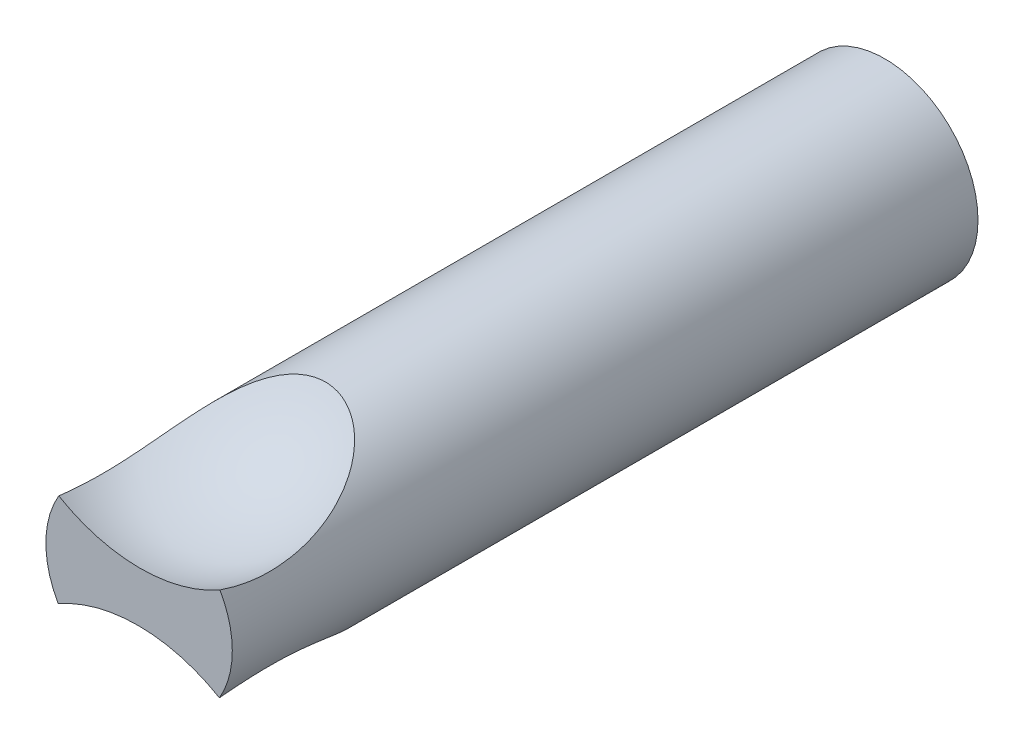
ISO-10303-21;
HEADER;
FILE_DESCRIPTION(('STEP AP214'),'2;1');
FILE_NAME('part.step','',(''),(''),'','','');
FILE_SCHEMA(('AUTOMOTIVE_DESIGN { 1 0 10303 214 1 1 1 1 }'));
ENDSEC;
DATA;
#1=APPLICATION_CONTEXT('core data for automotive mechanical design processes');
#2=APPLICATION_PROTOCOL_DEFINITION('international standard','automotive_design',2000,#1);
#3=PRODUCT_CONTEXT('',#1,'mechanical');
#4=PRODUCT('Part','Part','',(#3));
#5=PRODUCT_RELATED_PRODUCT_CATEGORY('part','',(#4));
#6=PRODUCT_DEFINITION_FORMATION('','',#4);
#7=PRODUCT_DEFINITION_CONTEXT('part definition',#1,'design');
#8=PRODUCT_DEFINITION('design','',#6,#7);
#9=PRODUCT_DEFINITION_SHAPE('','',#8);
#10=(LENGTH_UNIT() NAMED_UNIT(*) SI_UNIT(.MILLI.,.METRE.));
#11=(NAMED_UNIT(*) PLANE_ANGLE_UNIT() SI_UNIT($,.RADIAN.));
#12=(NAMED_UNIT(*) SI_UNIT($,.STERADIAN.) SOLID_ANGLE_UNIT());
#13=UNCERTAINTY_MEASURE_WITH_UNIT(LENGTH_MEASURE(1.E-05),#10,'distance_accuracy_value','');
#14=(GEOMETRIC_REPRESENTATION_CONTEXT(3) GLOBAL_UNCERTAINTY_ASSIGNED_CONTEXT((#13)) GLOBAL_UNIT_ASSIGNED_CONTEXT((#10,
#11,#12)) REPRESENTATION_CONTEXT('',''));
#15=CARTESIAN_POINT('',(0.,0.,0.));
#16=DIRECTION('',(0.,0.,1.));
#17=DIRECTION('',(1.,0.,0.));
#18=AXIS2_PLACEMENT_3D('',#15,#16,#17);
#19=CARTESIAN_POINT('',(0.,0.,0.));
#20=DIRECTION('',(0.,0.,1.));
#21=DIRECTION('',(1.,0.,0.));
#22=AXIS2_PLACEMENT_3D('',#19,#20,#21);
#23=CYLINDRICAL_SURFACE('',#22,12.7);
#24=CARTESIAN_POINT('',(0.,0.,-101.6));
#25=DIRECTION('',(0.,0.,1.));
#26=DIRECTION('',(1.,0.,0.));
#27=AXIS2_PLACEMENT_3D('',#24,#25,#26);
#28=CIRCLE('',#27,12.7);
#29=CARTESIAN_POINT('',(12.7,0.,-101.6));
#30=VERTEX_POINT('',#29);
#31=EDGE_CURVE('E70',#30,#30,#28,.T.);
#32=ORIENTED_EDGE('',*,*,#31,.T.);
#33=EDGE_LOOP('',(#32));
#34=FACE_BOUND('',#33,.T.);
#35=CARTESIAN_POINT('',(0.,0.,0.));
#36=DIRECTION('',(0.,0.,1.));
#37=DIRECTION('',(1.,0.,0.));
#38=AXIS2_PLACEMENT_3D('',#35,#36,#37);
#39=CIRCLE('',#38,12.7);
#40=CARTESIAN_POINT('',(10.9442336249683,-6.44311651005266,0.));
#41=VERTEX_POINT('',#40);
#42=CARTESIAN_POINT('',(11.0153436020415,6.32077569044845,0.));
#43=VERTEX_POINT('',#42);
#44=EDGE_CURVE('E67',#41,#43,#39,.T.);
#45=ORIENTED_EDGE('',*,*,#44,.F.);
#46=CARTESIAN_POINT('',(10.9442042844606,-6.44316634737872,0.000200000000000659));
#47=CARTESIAN_POINT('',(10.9820076797341,-6.37893548211798,-0.257531917326904));
#48=CARTESIAN_POINT('',(11.0169570010032,-6.31829670516524,-0.516574142293161));
#49=CARTESIAN_POINT('',(11.081461849067,-6.20447792054995,-1.03695611210328));
#50=CARTESIAN_POINT('',(11.1110174289167,-6.15129783952181,-1.29829583432151));
#51=CARTESIAN_POINT('',(11.1650464014589,-6.05267611276471,-1.82292101893643));
#52=CARTESIAN_POINT('',(11.1895204478493,-6.00723347181234,-2.08620622654391));
#53=CARTESIAN_POINT('',(11.2336476153591,-5.9243018027941,-2.61441559787994));
#54=CARTESIAN_POINT('',(11.2533007206288,-5.88681280087694,-2.87933976699385));
#55=CARTESIAN_POINT('',(11.3053296514065,-5.78665102480421,-3.67548054986068));
#56=CARTESIAN_POINT('',(11.3308444400335,-5.73615358711074,-4.20875249666291));
#57=CARTESIAN_POINT('',(11.3647331267084,-5.66870322467448,-5.27794283850334));
#58=CARTESIAN_POINT('',(11.373105208737,-5.65175385386569,-5.81386150789564));
#59=CARTESIAN_POINT('',(11.3731181068212,-5.65175827277442,-6.99127132063171));
#60=CARTESIAN_POINT('',(11.3611416986637,-5.67604118105522,-7.63278150896929));
#61=CARTESIAN_POINT('',(11.3124268648063,-5.77250844721932,-8.91130160618086));
#62=CARTESIAN_POINT('',(11.2756848059055,-5.84469983340699,-9.5483108408931));
#63=CARTESIAN_POINT('',(11.1749130342367,-6.03514261754072,-10.8147522677516));
#64=CARTESIAN_POINT('',(11.110820213725,-6.15350048302684,-11.4441634532402));
#65=CARTESIAN_POINT('',(10.9514363096182,-6.43287457505314,-12.6893863339042));
#66=CARTESIAN_POINT('',(10.8561475636867,-6.59388760506022,-13.3051990443902));
#67=CARTESIAN_POINT('',(10.6285962614954,-6.95475748288803,-14.5215849638082));
#68=CARTESIAN_POINT('',(10.4961648565551,-7.15479041820171,-15.1220745852325));
#69=CARTESIAN_POINT('',(10.1879319550013,-7.58726300345445,-16.3001866351298));
#70=CARTESIAN_POINT('',(10.0121156301282,-7.81971372142763,-16.8778011667751));
#71=CARTESIAN_POINT('',(9.61041585557241,-8.30840641696101,-18.0021070351676));
#72=CARTESIAN_POINT('',(9.3847266201491,-8.56455392480992,-18.5489082719709));
#73=CARTESIAN_POINT('',(8.87489508371701,-9.09178248788514,-19.6066716542961));
#74=CARTESIAN_POINT('',(8.59081872171284,-9.36284644665439,-20.1176733643336));
#75=CARTESIAN_POINT('',(8.11321506218924,-9.7729374817924,-20.8531005105631));
#76=CARTESIAN_POINT('',(7.94437194703063,-9.91097672353431,-21.0942877887903));
#77=CARTESIAN_POINT('',(7.58870928660985,-10.1858734621899,-21.5637838618446));
#78=CARTESIAN_POINT('',(7.40189201186729,-10.3227311059908,-21.7920942775296));
#79=CARTESIAN_POINT('',(7.00961667230995,-10.5930145779952,-22.2339441861003));
#80=CARTESIAN_POINT('',(6.80417322843412,-10.7264429942193,-22.4474950366274));
#81=CARTESIAN_POINT('',(6.37394151663585,-10.9875453952245,-22.8580303433999));
#82=CARTESIAN_POINT('',(6.14915640762253,-11.1152203145047,-23.0550174945014));
#83=CARTESIAN_POINT('',(5.72270792750069,-11.3396490677715,-23.3960465847484));
#84=CARTESIAN_POINT('',(5.52427122162314,-11.4378043368423,-23.5432030482055));
#85=CARTESIAN_POINT('',(5.11447944781201,-11.6268219164445,-23.8235310645928));
#86=CARTESIAN_POINT('',(4.9031270913456,-11.7176857485127,-23.9567055370059));
#87=CARTESIAN_POINT('',(4.46808806862796,-11.8903706403953,-24.2075359140492));
#88=CARTESIAN_POINT('',(4.24441072328907,-11.9721983968859,-24.3252033237137));
#89=CARTESIAN_POINT('',(3.78541568616707,-12.1251435280258,-24.5436106098362));
#90=CARTESIAN_POINT('',(3.55009981810283,-12.1962625736762,-24.6443531275606));
#91=CARTESIAN_POINT('',(3.10646436246534,-12.3160127867095,-24.8132018902771));
#92=CARTESIAN_POINT('',(2.89962621558651,-12.3664210538237,-24.8839467901612));
#93=CARTESIAN_POINT('',(2.47959439885494,-12.4574381463327,-25.0114505689185));
#94=CARTESIAN_POINT('',(2.26640186710286,-12.4980487148328,-25.0682119356355));
#95=CARTESIAN_POINT('',(1.83496251964225,-12.5686385448348,-25.1670011750845));
#96=CARTESIAN_POINT('',(1.61671731554386,-12.5986211478098,-25.2090336785798));
#97=CARTESIAN_POINT('',(1.17657393839343,-12.6473195946266,-25.2777998565141));
#98=CARTESIAN_POINT('',(0.954675711348258,-12.6660352717851,-25.3045333046177));
#99=CARTESIAN_POINT('',(0.50824959055181,-12.6918007937178,-25.3423556768875));
#100=CARTESIAN_POINT('',(0.283716118732721,-12.6988182099885,-25.3534011001233));
#101=CARTESIAN_POINT('',(-0.165625582343404,-12.7009072732764,-25.3595383805301));
#102=CARTESIAN_POINT('',(-0.39043381175637,-12.695978913511,-25.3546302286428));
#103=CARTESIAN_POINT('',(-0.838570241639726,-12.6742703764961,-25.3289357650434));
#104=CARTESIAN_POINT('',(-1.0618983764326,-12.6574896768199,-25.3081487534207));
#105=CARTESIAN_POINT('',(-1.50537107835578,-12.6124356801443,-25.2510096535637));
#106=CARTESIAN_POINT('',(-1.72551567805077,-12.5841625007887,-25.214657724661));
#107=CARTESIAN_POINT('',(-2.15204428904547,-12.5181204826773,-25.1287358607614));
#108=CARTESIAN_POINT('',(-2.35862056991829,-12.480793487334,-25.0797758189289));
#109=CARTESIAN_POINT('',(-2.76622806757851,-12.396825499268,-24.9686541368236));
#110=CARTESIAN_POINT('',(-2.96725959948413,-12.3501850370931,-24.9064932485332));
#111=CARTESIAN_POINT('',(-3.3628300632755,-12.2483914433685,-24.7696707870309));
#112=CARTESIAN_POINT('',(-3.55736795404735,-12.1932369546775,-24.6950072207229));
#113=CARTESIAN_POINT('',(-3.9391603159105,-12.0753036670106,-24.5339580708004));
#114=CARTESIAN_POINT('',(-4.12641329495258,-12.0125233168956,-24.4475701019619));
#115=CARTESIAN_POINT('',(-4.55809069609512,-11.8567907583657,-24.2312761669113));
#116=CARTESIAN_POINT('',(-4.79923008721467,-11.7610360782963,-24.0968042045703));
#117=CARTESIAN_POINT('',(-5.26609925791662,-11.559537353909,-23.8098125439967));
#118=CARTESIAN_POINT('',(-5.49182467277784,-11.4537905001831,-23.6572877669567));
#119=CARTESIAN_POINT('',(-5.92771837232355,-11.2344010704376,-23.3358951455887));
#120=CARTESIAN_POINT('',(-6.13786572397343,-11.1207482542814,-23.1670059899091));
#121=CARTESIAN_POINT('',(-6.5423103279476,-10.8877304597637,-22.8147777196696));
#122=CARTESIAN_POINT('',(-6.73660326059142,-10.7683639386134,-22.6314346935964));
#123=CARTESIAN_POINT('',(-7.18155841632776,-10.4790393002343,-22.1786557206873));
#124=CARTESIAN_POINT('',(-7.42506049189903,-10.3073245695837,-21.9032874196817));
#125=CARTESIAN_POINT('',(-7.88355064740844,-9.96103562632248,-21.3314283037417));
#126=CARTESIAN_POINT('',(-8.09852801874095,-9.78646036730315,-21.0349296199888));
#127=CARTESIAN_POINT('',(-8.50204287363975,-9.43803042367174,-20.4234260982968));
#128=CARTESIAN_POINT('',(-8.69054406441106,-9.26417703914607,-20.1083966817048));
#129=CARTESIAN_POINT('',(-9.04279669586375,-8.92066900042466,-19.4627086355149));
#130=CARTESIAN_POINT('',(-9.20654795311864,-8.75101437735453,-19.1320498901088));
#131=CARTESIAN_POINT('',(-9.57451867066405,-8.34987187850409,-18.3174625120818));
#132=CARTESIAN_POINT('',(-9.76745775011223,-8.12183662969899,-17.8267130835211));
#133=CARTESIAN_POINT('',(-10.1139178293784,-7.68610141050624,-16.8227357774244));
#134=CARTESIAN_POINT('',(-10.2674230904969,-7.47840957991651,-16.3094990201834));
#135=CARTESIAN_POINT('',(-10.5403722556859,-7.08852739600426,-15.2642123373829));
#136=CARTESIAN_POINT('',(-10.6597912423812,-6.90635574744812,-14.7321489671091));
#137=CARTESIAN_POINT('',(-10.8691041614954,-6.57202185110725,-13.6531152470184));
#138=CARTESIAN_POINT('',(-10.9590015634153,-6.41985607774592,-13.1061466571142));
#139=CARTESIAN_POINT('',(-11.115218181265,-6.14552651472174,-11.9864352522033));
#140=CARTESIAN_POINT('',(-11.1808815552969,-6.02422154950809,-11.4133905803779));
#141=CARTESIAN_POINT('',(-11.288724883895,-5.81962860482545,-10.2583426919338));
#142=CARTESIAN_POINT('',(-11.3309033847595,-5.73634297879183,-9.67633892304251));
#143=CARTESIAN_POINT('',(-11.3940798529921,-5.60980777129301,-8.50729946516729));
#144=CARTESIAN_POINT('',(-11.4150935698268,-5.56652842171344,-7.92026784614103));
#145=CARTESIAN_POINT('',(-11.437219342659,-5.52093271908258,-6.74429274554068));
#146=CARTESIAN_POINT('',(-11.4383340359319,-5.51861093780642,-6.1553495276645));
#147=CARTESIAN_POINT('',(-11.4224752876616,-5.55132451537671,-5.09642252689971));
#148=CARTESIAN_POINT('',(-11.4090651281004,-5.57900146461034,-4.62614027128976));
#149=CARTESIAN_POINT('',(-11.3690130719927,-5.66017793180843,-3.68842317796926));
#150=CARTESIAN_POINT('',(-11.3423727003701,-5.71367447376786,-3.22098801838423));
#151=CARTESIAN_POINT('',(-11.2749060722072,-5.84568108454389,-2.29076225393574));
#152=CARTESIAN_POINT('',(-11.2340826390445,-5.92418617472888,-1.82797074352673));
#153=CARTESIAN_POINT('',(-11.1611575568434,-6.05979931137157,-1.13856550283917));
#154=CARTESIAN_POINT('',(-11.134896914635,-6.10798665072995,-0.909532812350868));
#155=CARTESIAN_POINT('',(-11.0782536444399,-6.21012774392575,-0.453268136099403));
#156=CARTESIAN_POINT('',(-11.0478709815255,-6.2640815466243,-0.226036165611852));
#157=CARTESIAN_POINT('',(-11.0153148186436,-6.32082585159342,0.000200000000000517));
#158=B_SPLINE_CURVE_WITH_KNOTS('',3,(#46,#47,#48,#49,#50,#51,#52,#53,#54,#55,#56,#57,#58,#59,
#60,#61,#62,#63,#64,#65,#66,#67,#68,#69,#70,#71,#72,#73,#74,#75,#76,#77,#78,#79,#80,#81,#82,#83,
#84,#85,#86,#87,#88,#89,#90,#91,#92,#93,#94,#95,#96,#97,#98,#99,#100,#101,#102,#103,#104,#105,
#106,#107,#108,#109,#110,#111,#112,#113,#114,#115,#116,#117,#118,#119,#120,#121,#122,#123,#124,
#125,#126,#127,#128,#129,#130,#131,#132,#133,#134,#135,#136,#137,#138,#139,#140,#141,#142,#143,
#144,#145,#146,#147,#148,#149,#150,#151,#152,#153,#154,#155,#156,#157),.UNSPECIFIED.,.F.,.F.,(4,
2,2,2,2,2,2,2,2,2,2,2,2,2,2,2,2,2,2,2,2,2,2,2,2,2,2,2,2,2,2,2,2,2,2,2,2,2,2,2,2,2,2,2,2,2,2,2,2,
2,2,2,2,2,2,4),(0.,0.804827080520352,1.60964624400503,2.414361809795,3.21908002116024,
4.82641311723091,6.43391647795789,8.35779723526172,10.2819602935298,12.2105872786186,
14.1390697752965,16.0764652570463,18.014523828425,19.9451642290782,21.8736361410902,
22.8485249716444,23.8232908142378,24.7972980147363,25.7711464397996,26.5679364178443,
27.3645596914112,28.160588564597,28.9564930953962,29.6288179383144,30.3010230797903,
30.9730166895493,31.645020240573,32.3188835596055,32.9927472612482,33.6666406672641,
34.3405271750768,34.9864997513583,35.6324355398728,36.2784743974952,36.9246448834643,
37.8000551868059,38.6757123577885,39.5525256303593,40.4295770065102,41.6448873427415,
42.8606526417256,44.0780685439097,45.2954934681534,47.0165213023492,48.7382349642048,
50.4612040097643,52.1839704922084,53.9504314401478,55.7170017189753,57.4822564568016,
59.2472772385596,60.6602699945919,62.0730999258369,63.4856487704478,64.1920974430301,
64.898552102057),.UNSPECIFIED.);
#159=CARTESIAN_POINT('',(-11.0153436020415,-6.32077569044845,0.));
#160=VERTEX_POINT('',#159);
#161=EDGE_CURVE('E48',#41,#160,#158,.T.);
#162=ORIENTED_EDGE('',*,*,#161,.T.);
#163=CARTESIAN_POINT('',(-10.9442336249683,6.44311651005266,0.));
#164=VERTEX_POINT('',#163);
#165=EDGE_CURVE('E66',#164,#160,#39,.T.);
#166=ORIENTED_EDGE('',*,*,#165,.F.);
#167=CARTESIAN_POINT('',(-10.9442042844606,6.44316634737872,0.0002));
#168=CARTESIAN_POINT('',(-10.9820076797341,6.37893548211798,-0.257531917326905));
#169=CARTESIAN_POINT('',(-11.0169570010032,6.31829670516524,-0.516574142293162));
#170=CARTESIAN_POINT('',(-11.081461849067,6.20447792054995,-1.03695611210328));
#171=CARTESIAN_POINT('',(-11.1110174289167,6.15129783952181,-1.29829583432151));
#172=CARTESIAN_POINT('',(-11.1650464014589,6.05267611276471,-1.82292101893643));
#173=CARTESIAN_POINT('',(-11.1895204478493,6.00723347181234,-2.08620622654391));
#174=CARTESIAN_POINT('',(-11.2336476153591,5.9243018027941,-2.61441559787994));
#175=CARTESIAN_POINT('',(-11.2533007206288,5.88681280087694,-2.87933976699385));
#176=CARTESIAN_POINT('',(-11.3053296514065,5.78665102480421,-3.67548054986068));
#177=CARTESIAN_POINT('',(-11.3308444400335,5.73615358711074,-4.20875249666291));
#178=CARTESIAN_POINT('',(-11.3647331267084,5.66870322467448,-5.27794283850334));
#179=CARTESIAN_POINT('',(-11.373105208737,5.65175385386569,-5.81386150789564));
#180=CARTESIAN_POINT('',(-11.3731181068212,5.65175827277442,-6.99127132063171));
#181=CARTESIAN_POINT('',(-11.3611416986637,5.67604118105523,-7.63278150896929));
#182=CARTESIAN_POINT('',(-11.3124268648063,5.77250844721933,-8.91130160618086));
#183=CARTESIAN_POINT('',(-11.2756848059055,5.84469983340699,-9.54831084089311));
#184=CARTESIAN_POINT('',(-11.1749130342367,6.03514261754071,-10.8147522677516));
#185=CARTESIAN_POINT('',(-11.110820213725,6.15350048302684,-11.4441634532402));
#186=CARTESIAN_POINT('',(-10.9514363096182,6.43287457505314,-12.6893863339042));
#187=CARTESIAN_POINT('',(-10.8561475636867,6.59388760506022,-13.3051990443902));
#188=CARTESIAN_POINT('',(-10.6285962614954,6.95475748288803,-14.5215849638082));
#189=CARTESIAN_POINT('',(-10.4961648565551,7.15479041820172,-15.1220745852325));
#190=CARTESIAN_POINT('',(-10.1879319550013,7.58726300345445,-16.3001866351298));
#191=CARTESIAN_POINT('',(-10.0121156301282,7.81971372142764,-16.8778011667751));
#192=CARTESIAN_POINT('',(-9.6104158555724,8.30840641696101,-18.0021070351676));
#193=CARTESIAN_POINT('',(-9.3847266201491,8.56455392480992,-18.5489082719709));
#194=CARTESIAN_POINT('',(-8.87489508371701,9.09178248788514,-19.6066716542961));
#195=CARTESIAN_POINT('',(-8.59081872171284,9.36284644665439,-20.1176733643336));
#196=CARTESIAN_POINT('',(-8.11321506218924,9.7729374817924,-20.8531005105631));
#197=CARTESIAN_POINT('',(-7.94437194703063,9.91097672353431,-21.0942877887903));
#198=CARTESIAN_POINT('',(-7.58870928660986,10.1858734621899,-21.5637838618446));
#199=CARTESIAN_POINT('',(-7.40189201186729,10.3227311059908,-21.7920942775296));
#200=CARTESIAN_POINT('',(-7.00961667230995,10.5930145779952,-22.2339441861003));
#201=CARTESIAN_POINT('',(-6.80417322843412,10.7264429942193,-22.4474950366274));
#202=CARTESIAN_POINT('',(-6.37394151663584,10.9875453952245,-22.8580303433999));
#203=CARTESIAN_POINT('',(-6.14915640762252,11.1152203145047,-23.0550174945014));
#204=CARTESIAN_POINT('',(-5.72270792750069,11.3396490677715,-23.3960465847484));
#205=CARTESIAN_POINT('',(-5.52427122162314,11.4378043368423,-23.5432030482055));
#206=CARTESIAN_POINT('',(-5.11447944781202,11.6268219164445,-23.8235310645928));
#207=CARTESIAN_POINT('',(-4.9031270913456,11.7176857485127,-23.9567055370059));
#208=CARTESIAN_POINT('',(-4.46808806862796,11.8903706403953,-24.2075359140492));
#209=CARTESIAN_POINT('',(-4.24441072328907,11.9721983968859,-24.3252033237137));
#210=CARTESIAN_POINT('',(-3.78541568616708,12.1251435280258,-24.5436106098362));
#211=CARTESIAN_POINT('',(-3.55009981810284,12.1962625736762,-24.6443531275606));
#212=CARTESIAN_POINT('',(-3.10646436246535,12.3160127867095,-24.8132018902771));
#213=CARTESIAN_POINT('',(-2.89962621558652,12.3664210538237,-24.8839467901612));
#214=CARTESIAN_POINT('',(-2.47959439885494,12.4574381463327,-25.0114505689185));
#215=CARTESIAN_POINT('',(-2.26640186710287,12.4980487148328,-25.0682119356355));
#216=CARTESIAN_POINT('',(-1.83496251964225,12.5686385448348,-25.1670011750845));
#217=CARTESIAN_POINT('',(-1.61671731554387,12.5986211478098,-25.2090336785798));
#218=CARTESIAN_POINT('',(-1.17657393839344,12.6473195946266,-25.2777998565141));
#219=CARTESIAN_POINT('',(-0.954675711348265,12.6660352717851,-25.3045333046177));
#220=CARTESIAN_POINT('',(-0.508249590551818,12.6918007937178,-25.3423556768875));
#221=CARTESIAN_POINT('',(-0.283716118732728,12.6988182099885,-25.3534011001233));
#222=CARTESIAN_POINT('',(0.165625582343397,12.7009072732764,-25.3595383805301));
#223=CARTESIAN_POINT('',(0.390433811756364,12.695978913511,-25.3546302286428));
#224=CARTESIAN_POINT('',(0.838570241639719,12.6742703764961,-25.3289357650434));
#225=CARTESIAN_POINT('',(1.06189837643259,12.6574896768199,-25.3081487534207));
#226=CARTESIAN_POINT('',(1.50537107835577,12.6124356801443,-25.2510096535637));
#227=CARTESIAN_POINT('',(1.72551567805076,12.5841625007887,-25.214657724661));
#228=CARTESIAN_POINT('',(2.15204428904545,12.5181204826773,-25.1287358607614));
#229=CARTESIAN_POINT('',(2.35862056991827,12.480793487334,-25.0797758189289));
#230=CARTESIAN_POINT('',(2.76622806757849,12.396825499268,-24.9686541368236));
#231=CARTESIAN_POINT('',(2.96725959948412,12.3501850370931,-24.9064932485332));
#232=CARTESIAN_POINT('',(3.36283006327548,12.2483914433685,-24.7696707870309));
#233=CARTESIAN_POINT('',(3.55736795404733,12.1932369546775,-24.6950072207229));
#234=CARTESIAN_POINT('',(3.93916031591049,12.0753036670106,-24.5339580708004));
#235=CARTESIAN_POINT('',(4.12641329495257,12.0125233168956,-24.4475701019619));
#236=CARTESIAN_POINT('',(4.55809069609511,11.8567907583657,-24.2312761669114));
#237=CARTESIAN_POINT('',(4.79923008721465,11.7610360782963,-24.0968042045703));
#238=CARTESIAN_POINT('',(5.26609925791661,11.559537353909,-23.8098125439968));
#239=CARTESIAN_POINT('',(5.49182467277783,11.4537905001831,-23.6572877669568));
#240=CARTESIAN_POINT('',(5.92771837232354,11.2344010704376,-23.3358951455887));
#241=CARTESIAN_POINT('',(6.13786572397341,11.1207482542814,-23.1670059899091));
#242=CARTESIAN_POINT('',(6.54231032794758,10.8877304597637,-22.8147777196696));
#243=CARTESIAN_POINT('',(6.73660326059141,10.7683639386134,-22.6314346935964));
#244=CARTESIAN_POINT('',(7.18155841632775,10.4790393002343,-22.1786557206873));
#245=CARTESIAN_POINT('',(7.42506049189901,10.3073245695837,-21.9032874196817));
#246=CARTESIAN_POINT('',(7.88355064740843,9.96103562632249,-21.3314283037417));
#247=CARTESIAN_POINT('',(8.09852801874094,9.78646036730316,-21.0349296199888));
#248=CARTESIAN_POINT('',(8.50204287363974,9.43803042367175,-20.4234260982968));
#249=CARTESIAN_POINT('',(8.69054406441105,9.26417703914608,-20.1083966817048));
#250=CARTESIAN_POINT('',(9.04279669586374,8.92066900042467,-19.4627086355149));
#251=CARTESIAN_POINT('',(9.20654795311863,8.75101437735454,-19.1320498901088));
#252=CARTESIAN_POINT('',(9.57451867066405,8.3498718785041,-18.3174625120819));
#253=CARTESIAN_POINT('',(9.76745775011223,8.121836629699,-17.8267130835211));
#254=CARTESIAN_POINT('',(10.1139178293784,7.68610141050625,-16.8227357774244));
#255=CARTESIAN_POINT('',(10.2674230904969,7.47840957991652,-16.3094990201834));
#256=CARTESIAN_POINT('',(10.5403722556859,7.08852739600426,-15.2642123373829));
#257=CARTESIAN_POINT('',(10.6597912423812,6.90635574744812,-14.7321489671091));
#258=CARTESIAN_POINT('',(10.8691041614953,6.57202185110726,-13.6531152470184));
#259=CARTESIAN_POINT('',(10.9590015634153,6.41985607774593,-13.1061466571142));
#260=CARTESIAN_POINT('',(11.115218181265,6.14552651472175,-11.9864352522033));
#261=CARTESIAN_POINT('',(11.1808815552969,6.02422154950809,-11.4133905803779));
#262=CARTESIAN_POINT('',(11.288724883895,5.81962860482546,-10.2583426919338));
#263=CARTESIAN_POINT('',(11.3309033847595,5.73634297879183,-9.67633892304253));
#264=CARTESIAN_POINT('',(11.3940798529921,5.60980777129301,-8.5072994651673));
#265=CARTESIAN_POINT('',(11.4150935698268,5.56652842171344,-7.92026784614105));
#266=CARTESIAN_POINT('',(11.437219342659,5.52093271908258,-6.7442927455407));
#267=CARTESIAN_POINT('',(11.4383340359319,5.51861093780642,-6.15534952766452));
#268=CARTESIAN_POINT('',(11.4224752876616,5.55132451537671,-5.09642252689973));
#269=CARTESIAN_POINT('',(11.4090651281004,5.57900146461033,-4.62614027128978));
#270=CARTESIAN_POINT('',(11.3690130719927,5.66017793180842,-3.68842317796928));
#271=CARTESIAN_POINT('',(11.3423727003701,5.71367447376785,-3.22098801838424));
#272=CARTESIAN_POINT('',(11.2749060722072,5.84568108454389,-2.29076225393576));
#273=CARTESIAN_POINT('',(11.2340826390445,5.92418617472888,-1.82797074352674));
#274=CARTESIAN_POINT('',(11.1611575568434,6.05979931137158,-1.13856550283917));
#275=CARTESIAN_POINT('',(11.134896914635,6.10798665072995,-0.90953281235087));
#276=CARTESIAN_POINT('',(11.0782536444399,6.21012774392575,-0.453268136099404));
#277=CARTESIAN_POINT('',(11.0478709815255,6.26408154662429,-0.226036165611852));
#278=CARTESIAN_POINT('',(11.0153148186436,6.32082585159342,0.000200000000000291));
#279=B_SPLINE_CURVE_WITH_KNOTS('',3,(#167,#168,#169,#170,#171,#172,#173,#174,#175,#176,#177,
#178,#179,#180,#181,#182,#183,#184,#185,#186,#187,#188,#189,#190,#191,#192,#193,#194,#195,#196,
#197,#198,#199,#200,#201,#202,#203,#204,#205,#206,#207,#208,#209,#210,#211,#212,#213,#214,#215,
#216,#217,#218,#219,#220,#221,#222,#223,#224,#225,#226,#227,#228,#229,#230,#231,#232,#233,#234,
#235,#236,#237,#238,#239,#240,#241,#242,#243,#244,#245,#246,#247,#248,#249,#250,#251,#252,#253,
#254,#255,#256,#257,#258,#259,#260,#261,#262,#263,#264,#265,#266,#267,#268,#269,#270,#271,#272,
#273,#274,#275,#276,#277,#278),.UNSPECIFIED.,.F.,.F.,(4,2,2,2,2,2,2,2,2,2,2,2,2,2,2,2,2,2,2,2,2,
2,2,2,2,2,2,2,2,2,2,2,2,2,2,2,2,2,2,2,2,2,2,2,2,2,2,2,2,2,2,2,2,2,2,4),(0.,0.804827080520352,
1.60964624400503,2.414361809795,3.21908002116024,4.82641311723091,6.43391647795789,
8.35779723526172,10.2819602935298,12.2105872786186,14.1390697752965,16.0764652570463,
18.014523828425,19.9451642290782,21.8736361410902,22.8485249716444,23.8232908142378,
24.7972980147363,25.7711464397996,26.5679364178443,27.3645596914112,28.160588564597,
28.9564930953962,29.6288179383144,30.3010230797903,30.9730166895493,31.645020240573,
32.3188835596055,32.9927472612482,33.6666406672641,34.3405271750768,34.9864997513583,
35.6324355398728,36.2784743974952,36.9246448834642,37.8000551868058,38.6757123577885,
39.5525256303593,40.4295770065102,41.6448873427415,42.8606526417256,44.0780685439097,
45.2954934681534,47.0165213023492,48.7382349642048,50.4612040097643,52.1839704922084,
53.9504314401478,55.7170017189753,57.4822564568016,59.2472772385596,60.6602699945919,
62.0730999258369,63.4856487704478,64.1920974430301,64.898552102057),.UNSPECIFIED.);
#280=EDGE_CURVE('E54',#164,#43,#279,.T.);
#281=ORIENTED_EDGE('',*,*,#280,.T.);
#282=EDGE_LOOP('',(#45,#162,#166,#281));
#283=FACE_BOUND('',#282,.T.);
#284=ADVANCED_FACE('F34',(#34,#283),#23,.T.);
#285=CARTESIAN_POINT('',(0.,0.,-101.6));
#286=DIRECTION('',(0.,0.,-1.));
#287=DIRECTION('',(-1.,0.,0.));
#288=AXIS2_PLACEMENT_3D('',#285,#286,#287);
#289=PLANE('',#288);
#290=ORIENTED_EDGE('',*,*,#31,.F.);
#291=EDGE_LOOP('',(#290));
#292=FACE_BOUND('',#291,.T.);
#293=ADVANCED_FACE('F36',(#292),#289,.T.);
#294=CARTESIAN_POINT('',(12.7,0.,0.));
#295=DIRECTION('',(0.,0.,1.));
#296=DIRECTION('',(1.,0.,0.));
#297=AXIS2_PLACEMENT_3D('',#294,#295,#296);
#298=PLANE('',#297);
#299=ORIENTED_EDGE('',*,*,#165,.T.);
#300=CARTESIAN_POINT('',(-0.141508043885501,-25.4,0.));
#301=DIRECTION('',(0.,0.,1.));
#302=DIRECTION('',(1.,0.,0.));
#303=AXIS2_PLACEMENT_3D('',#300,#301,#302);
#304=CIRCLE('',#303,21.960352911554);
#305=EDGE_CURVE('E11',#160,#41,#304,.F.);
#306=ORIENTED_EDGE('',*,*,#305,.T.);
#307=ORIENTED_EDGE('',*,*,#44,.T.);
#308=CARTESIAN_POINT('',(0.141508043885502,25.4,0.));
#309=DIRECTION('',(0.,0.,1.));
#310=DIRECTION('',(1.,0.,0.));
#311=AXIS2_PLACEMENT_3D('',#308,#309,#310);
#312=CIRCLE('',#311,21.960352911554);
#313=EDGE_CURVE('E42',#43,#164,#312,.F.);
#314=ORIENTED_EDGE('',*,*,#313,.T.);
#315=EDGE_LOOP('',(#299,#306,#307,#314));
#316=FACE_BOUND('',#315,.T.);
#317=ADVANCED_FACE('F69',(#316),#298,.T.);
#318=CARTESIAN_POINT('',(0.141508043885501,25.4,-6.35));
#319=DIRECTION('',(-1.,0.,0.));
#320=DIRECTION('',(0.,0.,-1.));
#321=AXIS2_PLACEMENT_3D('',#318,#319,#320);
#322=SPHERICAL_SURFACE('',#321,22.86);
#323=ORIENTED_EDGE('',*,*,#313,.F.);
#324=ORIENTED_EDGE('',*,*,#280,.F.);
#325=EDGE_LOOP('',(#323,#324));
#326=FACE_BOUND('',#325,.T.);
#327=ADVANCED_FACE('F85',(#326),#322,.F.);
#328=CARTESIAN_POINT('',(-0.141508043885501,-25.4,-6.35));
#329=DIRECTION('',(1.,0.,0.));
#330=DIRECTION('',(0.,0.,-1.));
#331=AXIS2_PLACEMENT_3D('',#328,#329,#330);
#332=SPHERICAL_SURFACE('',#331,22.86);
#333=ORIENTED_EDGE('',*,*,#305,.F.);
#334=ORIENTED_EDGE('',*,*,#161,.F.);
#335=EDGE_LOOP('',(#333,#334));
#336=FACE_BOUND('',#335,.T.);
#337=ADVANCED_FACE('F60',(#336),#332,.F.);
#338=CLOSED_SHELL('',(#284,#293,#317,#327,#337));
#339=MANIFOLD_SOLID_BREP('B2',#338);
#340=ADVANCED_BREP_SHAPE_REPRESENTATION('',(#18,#339),#14);
#341=SHAPE_DEFINITION_REPRESENTATION(#9,#340);
ENDSEC;
END-ISO-10303-21;
